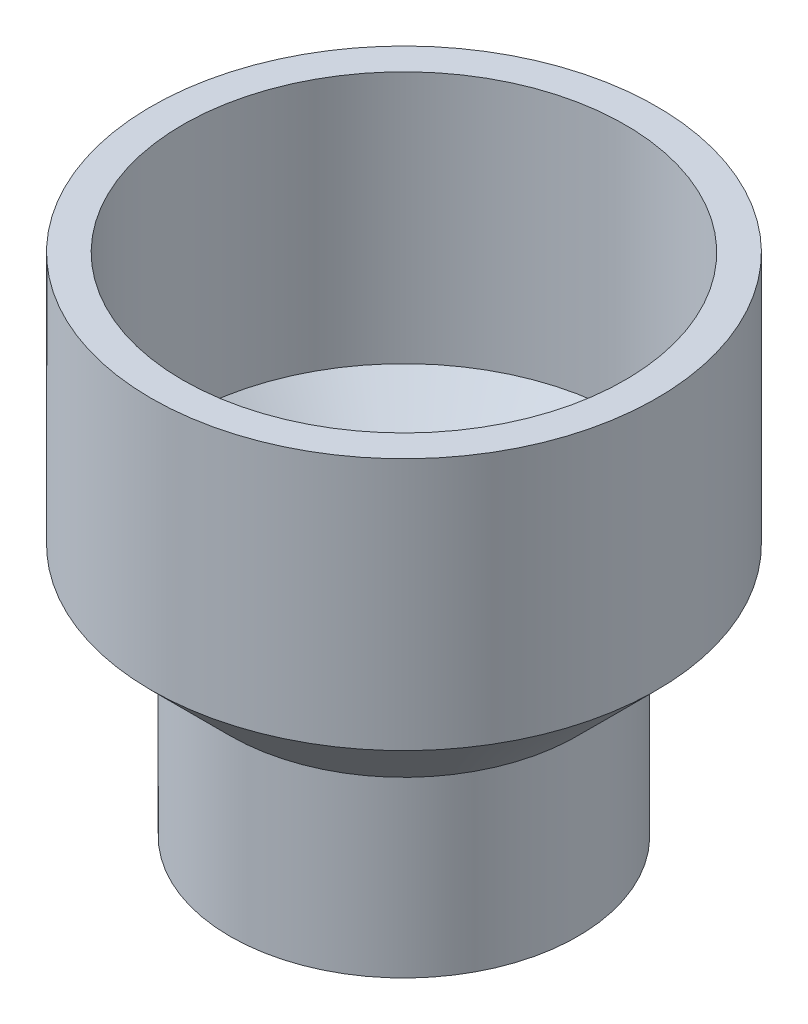
ISO-10303-21;
HEADER;
FILE_DESCRIPTION(('STEP AP214'),'2;1');
FILE_NAME('part.step','',(''),(''),'','','');
FILE_SCHEMA(('AUTOMOTIVE_DESIGN { 1 0 10303 214 1 1 1 1 }'));
ENDSEC;
DATA;
#1=APPLICATION_CONTEXT('core data for automotive mechanical design processes');
#2=APPLICATION_PROTOCOL_DEFINITION('international standard','automotive_design',2000,#1);
#3=PRODUCT_CONTEXT('',#1,'mechanical');
#4=PRODUCT('Part','Part','',(#3));
#5=PRODUCT_RELATED_PRODUCT_CATEGORY('part','',(#4));
#6=PRODUCT_DEFINITION_FORMATION('','',#4);
#7=PRODUCT_DEFINITION_CONTEXT('part definition',#1,'design');
#8=PRODUCT_DEFINITION('design','',#6,#7);
#9=PRODUCT_DEFINITION_SHAPE('','',#8);
#10=(LENGTH_UNIT() NAMED_UNIT(*) SI_UNIT(.MILLI.,.METRE.));
#11=(NAMED_UNIT(*) PLANE_ANGLE_UNIT() SI_UNIT($,.RADIAN.));
#12=(NAMED_UNIT(*) SI_UNIT($,.STERADIAN.) SOLID_ANGLE_UNIT());
#13=UNCERTAINTY_MEASURE_WITH_UNIT(LENGTH_MEASURE(1.E-05),#10,'distance_accuracy_value','');
#14=(GEOMETRIC_REPRESENTATION_CONTEXT(3) GLOBAL_UNCERTAINTY_ASSIGNED_CONTEXT((#13)) GLOBAL_UNIT_ASSIGNED_CONTEXT((#10,
#11,#12)) REPRESENTATION_CONTEXT('',''));
#15=CARTESIAN_POINT('',(0.,0.,0.));
#16=DIRECTION('',(0.,0.,1.));
#17=DIRECTION('',(1.,0.,0.));
#18=AXIS2_PLACEMENT_3D('',#15,#16,#17);
#19=CARTESIAN_POINT('',(0.,34.925,0.));
#20=DIRECTION('',(0.,1.,0.));
#21=DIRECTION('',(0.,0.,1.));
#22=AXIS2_PLACEMENT_3D('',#19,#20,#21);
#23=CONICAL_SURFACE('',#22,34.925,0.785398163397448);
#24=CARTESIAN_POINT('',(0.,50.8,0.));
#25=DIRECTION('',(0.,1.,0.));
#26=DIRECTION('',(0.,0.,1.));
#27=AXIS2_PLACEMENT_3D('',#24,#25,#26);
#28=CIRCLE('',#27,50.8);
#29=CARTESIAN_POINT('',(0.,50.8,50.8));
#30=VERTEX_POINT('',#29);
#31=EDGE_CURVE('E159',#30,#30,#28,.T.);
#32=ORIENTED_EDGE('',*,*,#31,.F.);
#33=EDGE_LOOP('',(#32));
#34=FACE_BOUND('',#33,.T.);
#35=CARTESIAN_POINT('',(-34.1928216678749,34.2136269063048,-1.19298469090279));
#36=CARTESIAN_POINT('',(-34.2815739286729,34.3071873596383,-1.33248830232444));
#37=CARTESIAN_POINT('',(-34.3822644038496,34.4129396518823,-1.45643275915809));
#38=CARTESIAN_POINT('',(-34.5442564447268,34.582172549158,-1.61977001671834));
#39=CARTESIAN_POINT('',(-34.6002611328489,34.6405386421686,-1.67056850402385));
#40=CARTESIAN_POINT('',(-34.715282358,34.7600926195074,-1.76498823194821));
#41=CARTESIAN_POINT('',(-34.774298251011,34.8212799001898,-1.80861099890575));
#42=CARTESIAN_POINT('',(-34.9050947539035,34.9565176618946,-1.89588157729996));
#43=CARTESIAN_POINT('',(-34.9773212813115,35.0309664446712,-1.93823584793034));
#44=CARTESIAN_POINT('',(-35.1243007538351,35.1819721298896,-2.01389412130694));
#45=CARTESIAN_POINT('',(-35.199055139687,35.2585302297571,-2.04719286172636));
#46=CARTESIAN_POINT('',(-35.4259401828212,35.490114077902,-2.13388822541286));
#47=CARTESIAN_POINT('',(-35.580969406127,35.6473357179681,-2.17426257163315));
#48=CARTESIAN_POINT('',(-35.8979237012877,35.966618306716,-2.22190034727807));
#49=CARTESIAN_POINT('',(-36.0599254518491,36.1287094895024,-2.22841353334702));
#50=CARTESIAN_POINT('',(-36.383865205535,36.4506683988246,-2.20591729754882));
#51=CARTESIAN_POINT('',(-36.5458032143611,36.6105364279312,-2.1769127584516));
#52=CARTESIAN_POINT('',(-36.8391267528299,36.8982845680241,-2.08910685997467));
#53=CARTESIAN_POINT('',(-36.9712142280511,37.027153264726,-2.035889583643));
#54=CARTESIAN_POINT('',(-37.2284087290584,37.2768407889738,-1.90104899976281));
#55=CARTESIAN_POINT('',(-37.3535257326408,37.3976711736399,-1.81946757258494));
#56=CARTESIAN_POINT('',(-37.5589466670998,37.5951863219014,-1.65198312741879));
#57=CARTESIAN_POINT('',(-37.6421802400883,37.6749365264546,-1.57329728470783));
#58=CARTESIAN_POINT('',(-37.799000676044,37.8247693154842,-1.39887434923891));
#59=CARTESIAN_POINT('',(-37.8726015345278,37.8948659337248,-1.30316248213122));
#60=CARTESIAN_POINT('',(-37.9918300356899,38.0081575473654,-1.11706977716215));
#61=CARTESIAN_POINT('',(-38.0400735206233,38.0538995201416,-1.02992930778994));
#62=CARTESIAN_POINT('',(-38.1257160336948,38.1349862807222,-0.845922810385251));
#63=CARTESIAN_POINT('',(-38.1631203510313,38.1703361396978,-0.749061556984511));
#64=CARTESIAN_POINT('',(-38.224852075787,38.2286238483345,-0.546606643749594));
#65=CARTESIAN_POINT('',(-38.24906133871,38.2514495724549,-0.440943552149376));
#66=CARTESIAN_POINT('',(-38.281752245055,38.2822623870848,-0.2251184870685));
#67=CARTESIAN_POINT('',(-38.2902492673325,38.2902639871922,-0.114961020681341));
#68=CARTESIAN_POINT('',(-38.2907054540785,38.2906933859733,0.0896977472742306));
#69=CARTESIAN_POINT('',(-38.2848411452526,38.2851708350689,0.184201578929087));
#70=CARTESIAN_POINT('',(-38.2614233809035,38.2631028536059,0.370408022381201));
#71=CARTESIAN_POINT('',(-38.2438701735165,38.2465576570401,0.462110693599311));
#72=CARTESIAN_POINT('',(-38.1986120030856,38.2038531853297,0.638906156772312));
#73=CARTESIAN_POINT('',(-38.1710756476569,38.177853567228,0.724081806864399));
#74=CARTESIAN_POINT('',(-38.1073100233382,38.117564293387,0.887956022817296));
#75=CARTESIAN_POINT('',(-38.0710769638313,38.0832710226586,0.966651744138984));
#76=CARTESIAN_POINT('',(-37.9742799609917,37.9915047808101,1.14907154112584));
#77=CARTESIAN_POINT('',(-37.9099565287235,37.930408413165,1.24898640625059));
#78=CARTESIAN_POINT('',(-37.7706300816689,37.7976915269845,1.43316403567811));
#79=CARTESIAN_POINT('',(-37.6956048236597,37.726049078761,1.51739333589181));
#80=CARTESIAN_POINT('',(-37.5098788462459,37.5481281678714,1.69785652485617));
#81=CARTESIAN_POINT('',(-37.3960074508017,37.4386187016103,1.78763151333976));
#82=CARTESIAN_POINT('',(-37.1600471781957,37.2106052899615,1.94082134761576));
#83=CARTESIAN_POINT('',(-37.0379470207927,37.0920889680914,2.00419911677091));
#84=CARTESIAN_POINT('',(-36.7521712758416,36.813287791729,2.12175649282107));
#85=CARTESIAN_POINT('',(-36.5869239390453,36.651057273554,2.16760495077396));
#86=CARTESIAN_POINT('',(-36.3377675947883,36.4047650670886,2.20767213781184));
#87=CARTESIAN_POINT('',(-36.2544202526825,36.3220954387245,2.21623798216892));
#88=CARTESIAN_POINT('',(-36.0877889324423,36.156251207392,2.22397628877756));
#89=CARTESIAN_POINT('',(-36.0045049567959,36.0730765856414,2.2231483994826));
#90=CARTESIAN_POINT('',(-35.753681817889,35.8217056139591,2.20658279451753));
#91=CARTESIAN_POINT('',(-35.5868938399194,35.6533643114749,2.17649178394227));
#92=CARTESIAN_POINT('',(-35.3422090532195,35.4046808172658,2.10237603597874));
#93=CARTESIAN_POINT('',(-35.2615705162135,35.3224314730166,2.07284479223785));
#94=CARTESIAN_POINT('',(-35.1026998954672,35.159832607027,2.00379589214626));
#95=CARTESIAN_POINT('',(-35.0244668567957,35.0794823344048,1.96428225753559));
#96=CARTESIAN_POINT('',(-34.8413319578,34.8907612451981,1.8574211553895));
#97=CARTESIAN_POINT('',(-34.7378966197466,34.7836515335427,1.78522577312632));
#98=CARTESIAN_POINT('',(-34.5401937781012,34.5780395287206,1.61923861818103));
#99=CARTESIAN_POINT('',(-34.4459120147098,34.4795238725092,1.52548122908911));
#100=CARTESIAN_POINT('',(-34.2942988888423,34.3205038368468,1.34296492978056));
#101=CARTESIAN_POINT('',(-34.2338248601263,34.2568755318755,1.25956147613049));
#102=CARTESIAN_POINT('',(-34.1227113007635,34.1396866188751,1.08002784435743));
#103=CARTESIAN_POINT('',(-34.0720577520681,34.0861116639546,0.983916141194465));
#104=CARTESIAN_POINT('',(-33.9929352215248,34.0022741402853,0.80086872463288));
#105=CARTESIAN_POINT('',(-33.9620445265015,33.9694815765301,0.716150908403326));
#106=CARTESIAN_POINT('',(-33.9102655141043,33.9144594049002,0.540421000340964));
#107=CARTESIAN_POINT('',(-33.8893695812095,33.8922217547961,0.449413761451168));
#108=CARTESIAN_POINT('',(-33.8590459510252,33.8599364012714,0.262715280396128));
#109=CARTESIAN_POINT('',(-33.8496937197498,33.8499689141696,0.166997425448759));
#110=CARTESIAN_POINT('',(-33.8435655657787,33.8434386868558,-0.0252936843850653));
#111=CARTESIAN_POINT('',(-33.8467859394926,33.846871999087,-0.121866679005382));
#112=CARTESIAN_POINT('',(-33.8645161226032,33.8657597889114,-0.302591756849646));
#113=CARTESIAN_POINT('',(-33.8778347412147,33.8799458239408,-0.387002246416707));
#114=CARTESIAN_POINT('',(-33.9134089506826,33.9177963133625,-0.551676413411459));
#115=CARTESIAN_POINT('',(-33.935666654962,33.9414630092163,-0.631939105127771));
#116=CARTESIAN_POINT('',(-33.9915413043621,34.00078958663,-0.797825528583115));
#117=CARTESIAN_POINT('',(-34.0263145311833,34.0376669904231,-0.882619154583177));
#118=CARTESIAN_POINT('',(-34.1039219363454,34.1198051214229,-1.04400576240388));
#119=CARTESIAN_POINT('',(-34.1467643111159,34.1650743721049,-1.12059028040963));
#120=CARTESIAN_POINT('',(-34.1928216678749,34.2136269063048,-1.19298469090279));
#121=B_SPLINE_CURVE_WITH_KNOTS('',3,(#35,#36,#37,#38,#39,#40,#41,#42,#43,#44,#45,#46,#47,#48,
#49,#50,#51,#52,#53,#54,#55,#56,#57,#58,#59,#60,#61,#62,#63,#64,#65,#66,#67,#68,#69,#70,#71,#72,
#73,#74,#75,#76,#77,#78,#79,#80,#81,#82,#83,#84,#85,#86,#87,#88,#89,#90,#91,#92,#93,#94,#95,#96,
#97,#98,#99,#100,#101,#102,#103,#104,#105,#106,#107,#108,#109,#110,#111,#112,#113,#114,#115,
#116,#117,#118,#119,#120),.UNSPECIFIED.,.T.,.F.,(4,2,2,2,2,2,2,2,2,2,2,2,2,2,2,2,2,2,2,2,2,2,2,
2,2,2,2,2,2,2,2,2,2,2,2,2,2,2,2,2,2,2,4),(0.,0.56930427315891,0.855648265760131,
1.14193127150024,1.47759449476423,1.81345236298535,2.48387467881956,3.16908975068613,
3.85421063375119,4.42841530296703,5.00177572028793,5.41911169018283,5.83583441090758,
6.16340200162617,6.49080947868913,6.82110221990237,7.15107150511431,7.43419718596454,
7.71731685670932,7.99586207160034,8.27452891667899,8.67315674735451,9.07262551722157,
9.61478426544557,10.1577019641733,10.8619682427121,11.2147825649174,11.5676100907178,
12.2804980469708,12.6368792393542,12.9931170799926,13.4879563576247,13.9820119511951,
14.3440869735493,14.7056412911163,14.9923652428618,15.2788703755501,15.5672387587313,
15.855522201856,16.1142520185619,16.3730430414954,16.6681780361975,16.9636144541266),.UNSPECIFIED.);
#122=CARTESIAN_POINT('',(-34.874636003521,34.9249999999998,-1.87493696478331));
#123=VERTEX_POINT('',#122);
#124=CARTESIAN_POINT('',(-34.8746360035211,34.925,1.87493696478255));
#125=VERTEX_POINT('',#124);
#126=EDGE_CURVE('E73',#123,#125,#121,.T.);
#127=ORIENTED_EDGE('',*,*,#126,.T.);
#128=CARTESIAN_POINT('',(0.,34.925,0.));
#129=DIRECTION('',(0.,1.,0.));
#130=DIRECTION('',(0.,0.,1.));
#131=AXIS2_PLACEMENT_3D('',#128,#129,#130);
#132=CIRCLE('',#131,34.925);
#133=EDGE_CURVE('E61',#125,#123,#132,.T.);
#134=ORIENTED_EDGE('',*,*,#133,.T.);
#135=EDGE_LOOP('',(#127,#134));
#136=FACE_BOUND('',#135,.T.);
#137=ADVANCED_FACE('F46',(#34,#136),#23,.T.);
#138=CARTESIAN_POINT('',(0.,50.8,0.));
#139=DIRECTION('',(0.,1.,0.));
#140=DIRECTION('',(0.,0.,1.));
#141=AXIS2_PLACEMENT_3D('',#138,#139,#140);
#142=CONICAL_SURFACE('',#141,44.45,0.80667154942151);
#143=CARTESIAN_POINT('',(0.,36.195,0.));
#144=DIRECTION('',(0.,1.,0.));
#145=DIRECTION('',(0.,0.,1.));
#146=AXIS2_PLACEMENT_3D('',#143,#144,#145);
#147=CIRCLE('',#146,29.21);
#148=CARTESIAN_POINT('',(0.,36.195,29.21));
#149=VERTEX_POINT('',#148);
#150=EDGE_CURVE('E139',#149,#149,#147,.T.);
#151=ORIENTED_EDGE('',*,*,#150,.F.);
#152=EDGE_LOOP('',(#151));
#153=FACE_BOUND('',#152,.T.);
#154=CARTESIAN_POINT('',(0.,50.8,0.));
#155=DIRECTION('',(0.,1.,0.));
#156=DIRECTION('',(0.,0.,1.));
#157=AXIS2_PLACEMENT_3D('',#154,#155,#156);
#158=CIRCLE('',#157,44.45);
#159=CARTESIAN_POINT('',(0.,50.8,44.45));
#160=VERTEX_POINT('',#159);
#161=EDGE_CURVE('E135',#160,#160,#158,.T.);
#162=ORIENTED_EDGE('',*,*,#161,.T.);
#163=EDGE_LOOP('',(#162));
#164=FACE_BOUND('',#163,.T.);
#165=CARTESIAN_POINT('',(-36.5259818198455,43.2681417658696,-2.17480088805643));
#166=CARTESIAN_POINT('',(-36.661001675679,43.3956873847848,-2.14636979127616));
#167=CARTESIAN_POINT('',(-36.794969011842,43.5215387539893,-2.10506606877575));
#168=CARTESIAN_POINT('',(-37.0576729797944,43.7670658510139,-1.9950760341765));
#169=CARTESIAN_POINT('',(-37.1864068978209,43.8867383832996,-1.9263757103528));
#170=CARTESIAN_POINT('',(-37.4071014862912,44.0909484250745,-1.77763755899297));
#171=CARTESIAN_POINT('',(-37.5010009673615,44.1774934150706,-1.7032495605437));
#172=CARTESIAN_POINT('',(-37.679426899241,44.3414076145758,-1.53549774165439));
#173=CARTESIAN_POINT('',(-37.763967560989,44.4187907487171,-1.44216331863202));
#174=CARTESIAN_POINT('',(-37.9029227259978,44.5456357267972,-1.25813052844446));
#175=CARTESIAN_POINT('',(-37.9599227085555,44.5975375479028,-1.17107889261206));
#176=CARTESIAN_POINT('',(-38.0628253849848,44.6910731274425,-0.985588522482347));
#177=CARTESIAN_POINT('',(-38.1087404991799,44.7327183791758,-0.887162717308619));
#178=CARTESIAN_POINT('',(-38.1806420453065,44.7978540353061,-0.696415895481467));
#179=CARTESIAN_POINT('',(-38.2086013015951,44.8231459347913,-0.605459042442303));
#180=CARTESIAN_POINT('',(-38.2528512939901,44.8631497925646,-0.418496456156211));
#181=CARTESIAN_POINT('',(-38.2691483348075,44.8778674674023,-0.322493481074282));
#182=CARTESIAN_POINT('',(-38.2889874264714,44.8957815496228,-0.12777353628579));
#183=CARTESIAN_POINT('',(-38.2924876110624,44.8989401402836,-0.0290487210961127));
#184=CARTESIAN_POINT('',(-38.2863508290911,44.8934002416069,0.167654618383073));
#185=CARTESIAN_POINT('',(-38.2767134163107,44.8847013495307,0.265633117210316));
#186=CARTESIAN_POINT('',(-38.2458525498616,44.8568224467192,0.452760023223517));
#187=CARTESIAN_POINT('',(-38.2252632299344,44.8382160410486,0.5421020372786));
#188=CARTESIAN_POINT('',(-38.1741513037724,44.7919733807713,0.71540403300947));
#189=CARTESIAN_POINT('',(-38.1436268782013,44.7643354722942,0.79936302556242));
#190=CARTESIAN_POINT('',(-38.0710900748298,44.6985611410484,0.967598230497573));
#191=CARTESIAN_POINT('',(-38.0283075512628,44.659718942241,1.05126253267649));
#192=CARTESIAN_POINT('',(-37.9346776036788,44.5745486492664,1.20975707041488));
#193=CARTESIAN_POINT('',(-37.8838249821896,44.5282157304069,1.28458155822371));
#194=CARTESIAN_POINT('',(-37.747209411037,44.4034687360198,1.46222467643687));
#195=CARTESIAN_POINT('',(-37.6571892074395,44.3210313432812,1.55896841173131));
#196=CARTESIAN_POINT('',(-37.4671571777423,44.1463306940037,1.73159554747825));
#197=CARTESIAN_POINT('',(-37.3671218077256,44.0540442488081,1.80742814173825));
#198=CARTESIAN_POINT('',(-37.1271373419162,43.8317187679327,1.96062373564006));
#199=CARTESIAN_POINT('',(-36.9847662982478,43.6991435326702,2.03050520525936));
#200=CARTESIAN_POINT('',(-36.6946062522483,43.4273348507675,2.13795088669352));
#201=CARTESIAN_POINT('',(-36.5468151282252,43.2880987901103,2.17550229902914));
#202=CARTESIAN_POINT('',(-36.2470897914556,43.0039859465758,2.22054058898386));
#203=CARTESIAN_POINT('',(-36.0951286490201,42.8590528798231,2.22748066885134));
#204=CARTESIAN_POINT('',(-35.7927557245771,42.5688310100667,2.21058914491142));
#205=CARTESIAN_POINT('',(-35.6423463883226,42.4235419925798,2.18671477788865));
#206=CARTESIAN_POINT('',(-35.4105279846211,42.1982077054035,2.12480658614162));
#207=CARTESIAN_POINT('',(-35.3273058151122,42.1170173920728,2.09730229179691));
#208=CARTESIAN_POINT('',(-35.1631992237528,41.9563523836428,2.03190723721162));
#209=CARTESIAN_POINT('',(-35.0823156397849,41.876878305966,1.99401280408115));
#210=CARTESIAN_POINT('',(-34.9239742590018,41.7207600491715,1.90757148007161));
#211=CARTESIAN_POINT('',(-34.846508622514,41.644109468634,1.85905067205646));
#212=CARTESIAN_POINT('',(-34.6959214936443,41.4946157604691,1.75085518082706));
#213=CARTESIAN_POINT('',(-34.6227960921273,41.4217692139819,1.69119074162216));
#214=CARTESIAN_POINT('',(-34.4749999145291,41.2740818708901,1.55341075281249));
#215=CARTESIAN_POINT('',(-34.4009335301625,41.1997967332412,1.47403336512572));
#216=CARTESIAN_POINT('',(-34.2622770127271,41.060310318879,1.30045009759266));
#217=CARTESIAN_POINT('',(-34.1976710834445,40.9950939094133,1.20626949297401));
#218=CARTESIAN_POINT('',(-34.0927563854578,40.888927112644,1.02310946431996));
#219=CARTESIAN_POINT('',(-34.0501682675686,40.845727178956,0.936757692119643));
#220=CARTESIAN_POINT('',(-33.9754639461146,40.7698332725828,0.755253443197067));
#221=CARTESIAN_POINT('',(-33.9433426108928,40.7371341516706,0.660105308620978));
#222=CARTESIAN_POINT('',(-33.8916173644961,40.6844289961763,0.461982163732396));
#223=CARTESIAN_POINT('',(-33.8721333868937,40.6645445893649,0.358942249871895));
#224=CARTESIAN_POINT('',(-33.8480280553051,40.6399384209022,0.149383342579902));
#225=CARTESIAN_POINT('',(-33.843391448974,40.6352010990252,0.0428680330784697));
#226=CARTESIAN_POINT('',(-33.8489532804607,40.6408805807832,-0.153297480210282));
#227=CARTESIAN_POINT('',(-33.8570347248608,40.6491348795437,-0.243085267526754));
#228=CARTESIAN_POINT('',(-33.8836162797459,40.6762603998127,-0.419434323822031));
#229=CARTESIAN_POINT('',(-33.9021177501534,40.6951330071212,-0.505995170078767));
#230=CARTESIAN_POINT('',(-33.9484539662989,40.7423358781636,-0.674313995123649));
#231=CARTESIAN_POINT('',(-33.9763353666488,40.7707134150819,-0.756045516006443));
#232=CARTESIAN_POINT('',(-34.0399358207845,40.8353362398596,-0.913043913092566));
#233=CARTESIAN_POINT('',(-34.0756585031612,40.8715851701605,-0.988307773843636));
#234=CARTESIAN_POINT('',(-34.1739089986402,40.9710844086848,-1.16934957523724));
#235=CARTESIAN_POINT('',(-34.2406886225336,41.0385453523837,-1.27051742505544));
#236=CARTESIAN_POINT('',(-34.3850437252816,41.1838485058071,-1.45639406626953));
#237=CARTESIAN_POINT('',(-34.4626454984428,41.2617159802107,-1.54106152830388));
#238=CARTESIAN_POINT('',(-34.6568176637053,41.4557917153247,-1.72396077246119));
#239=CARTESIAN_POINT('',(-34.7769277083094,41.5752601119243,-1.81496288949073));
#240=CARTESIAN_POINT('',(-35.0265284898469,41.8220943565224,-1.96885323858367));
#241=CARTESIAN_POINT('',(-35.1560313648294,41.949470391561,-2.03170431182112));
#242=CARTESIAN_POINT('',(-35.4244991434315,42.2119794208019,-2.13225464687039));
#243=CARTESIAN_POINT('',(-35.5636270783533,42.3472296385404,-2.16920520198415));
#244=CARTESIAN_POINT('',(-35.8447400293673,42.6188622861585,-2.21583475720021));
#245=CARTESIAN_POINT('',(-35.9867192001109,42.7552421180395,-2.22556475513689));
#246=CARTESIAN_POINT('',(-36.2614779046729,43.0176133728407,-2.2180295337673));
#247=CARTESIAN_POINT('',(-36.3942309478818,43.14368417107,-2.20254363573276));
#248=CARTESIAN_POINT('',(-36.5259818198455,43.2681417658696,-2.17480088805643));
#249=B_SPLINE_CURVE_WITH_KNOTS('',3,(#165,#166,#167,#168,#169,#170,#171,#172,#173,#174,#175,
#176,#177,#178,#179,#180,#181,#182,#183,#184,#185,#186,#187,#188,#189,#190,#191,#192,#193,#194,
#195,#196,#197,#198,#199,#200,#201,#202,#203,#204,#205,#206,#207,#208,#209,#210,#211,#212,#213,
#214,#215,#216,#217,#218,#219,#220,#221,#222,#223,#224,#225,#226,#227,#228,#229,#230,#231,#232,
#233,#234,#235,#236,#237,#238,#239,#240,#241,#242,#243,#244,#245,#246,#247,#248),.UNSPECIFIED.,
.T.,.F.,(4,2,2,2,2,2,2,2,2,2,2,2,2,2,2,2,2,2,2,2,2,2,2,2,2,2,2,2,2,2,2,2,2,2,2,2,2,2,2,2,2,4),
(0.,0.563268731436876,1.12682591140014,1.56871457506684,2.00992277084337,2.35746648428044,
2.70461895710865,2.99874180649918,3.29270552974472,3.5876301298232,3.88256474725184,
4.16203160447773,4.44154966705047,4.74546434821791,5.04957556317959,5.51423325154916,
5.98001013066666,6.59686278100767,7.21395953134459,7.84203571526464,8.47098445931379,
8.82900336953943,9.18714900214803,9.54442521243488,9.90137459155334,10.2947654435001,
10.6874917680632,11.0028851192902,11.3181236059046,11.6363116757588,11.954172773683,
12.2244478414961,12.4947581912094,12.7664334132865,13.0382346204186,13.4520869207453,
13.8669628582642,14.4407768327551,15.0153460142492,15.6059065203723,16.195359865432,
16.7449912219355),.UNSPECIFIED.);
#250=CARTESIAN_POINT('',(-36.5259818198455,43.2681417658696,-2.17480088805643));
#251=VERTEX_POINT('',#250);
#252=EDGE_CURVE('E50',#251,#251,#249,.T.);
#253=ORIENTED_EDGE('',*,*,#252,.F.);
#254=EDGE_LOOP('',(#253));
#255=FACE_BOUND('',#254,.T.);
#256=ADVANCED_FACE('F94',(#153,#164,#255),#142,.F.);
#257=CARTESIAN_POINT('',(0.,50.8,0.));
#258=DIRECTION('',(0.,-1.,0.));
#259=DIRECTION('',(0.,0.,-1.));
#260=AXIS2_PLACEMENT_3D('',#257,#258,#259);
#261=CYLINDRICAL_SURFACE('',#260,30.1625);
#262=CARTESIAN_POINT('',(0.,0.,0.));
#263=DIRECTION('',(0.,1.,0.));
#264=DIRECTION('',(0.,0.,1.));
#265=AXIS2_PLACEMENT_3D('',#262,#263,#264);
#266=CIRCLE('',#265,30.1625);
#267=CARTESIAN_POINT('',(0.,0.,30.1625));
#268=VERTEX_POINT('',#267);
#269=EDGE_CURVE('E163',#268,#268,#266,.T.);
#270=ORIENTED_EDGE('',*,*,#269,.F.);
#271=EDGE_LOOP('',(#270));
#272=FACE_BOUND('',#271,.T.);
#273=CARTESIAN_POINT('',(0.,35.7124,0.));
#274=DIRECTION('',(0.,1.,0.));
#275=DIRECTION('',(0.,0.,1.));
#276=AXIS2_PLACEMENT_3D('',#273,#274,#275);
#277=CIRCLE('',#276,30.1625);
#278=CARTESIAN_POINT('',(0.,35.7124,30.1625));
#279=VERTEX_POINT('',#278);
#280=EDGE_CURVE('E143',#279,#279,#277,.F.);
#281=ORIENTED_EDGE('',*,*,#280,.F.);
#282=EDGE_LOOP('',(#281));
#283=FACE_BOUND('',#282,.T.);
#284=ADVANCED_FACE('F86',(#272,#283),#261,.F.);
#285=CARTESIAN_POINT('',(0.,50.8,0.));
#286=DIRECTION('',(0.,-1.,0.));
#287=DIRECTION('',(0.,0.,-1.));
#288=AXIS2_PLACEMENT_3D('',#285,#286,#287);
#289=CYLINDRICAL_SURFACE('',#288,34.925);
#290=CARTESIAN_POINT('',(0.,0.,0.));
#291=DIRECTION('',(0.,1.,0.));
#292=DIRECTION('',(0.,0.,1.));
#293=AXIS2_PLACEMENT_3D('',#290,#291,#292);
#294=CIRCLE('',#293,34.925);
#295=CARTESIAN_POINT('',(0.,0.,34.925));
#296=VERTEX_POINT('',#295);
#297=EDGE_CURVE('E83',#296,#296,#294,.T.);
#298=ORIENTED_EDGE('',*,*,#297,.T.);
#299=EDGE_LOOP('',(#298));
#300=FACE_BOUND('',#299,.T.);
#301=EDGE_CURVE('E12',#123,#125,#132,.T.);
#302=ORIENTED_EDGE('',*,*,#301,.F.);
#303=ORIENTED_EDGE('',*,*,#133,.F.);
#304=EDGE_LOOP('',(#302,#303));
#305=FACE_BOUND('',#304,.T.);
#306=ADVANCED_FACE('F48',(#300,#305),#289,.T.);
#307=CARTESIAN_POINT('',(0.,0.,0.));
#308=DIRECTION('',(0.,1.,0.));
#309=DIRECTION('',(0.,0.,1.));
#310=AXIS2_PLACEMENT_3D('',#307,#308,#309);
#311=PLANE('',#310);
#312=ORIENTED_EDGE('',*,*,#297,.F.);
#313=EDGE_LOOP('',(#312));
#314=FACE_BOUND('',#313,.T.);
#315=ORIENTED_EDGE('',*,*,#269,.T.);
#316=EDGE_LOOP('',(#315));
#317=FACE_BOUND('',#316,.T.);
#318=ADVANCED_FACE('F85',(#314,#317),#311,.F.);
#319=CARTESIAN_POINT('',(0.,101.6,0.));
#320=DIRECTION('',(0.,1.,0.));
#321=DIRECTION('',(0.,0.,1.));
#322=AXIS2_PLACEMENT_3D('',#319,#320,#321);
#323=PLANE('',#322);
#324=CARTESIAN_POINT('',(0.,101.6,0.));
#325=DIRECTION('',(0.,1.,0.));
#326=DIRECTION('',(0.,0.,1.));
#327=AXIS2_PLACEMENT_3D('',#324,#325,#326);
#328=CIRCLE('',#327,50.8);
#329=CARTESIAN_POINT('',(0.,101.6,50.8));
#330=VERTEX_POINT('',#329);
#331=EDGE_CURVE('E155',#330,#330,#328,.T.);
#332=ORIENTED_EDGE('',*,*,#331,.T.);
#333=EDGE_LOOP('',(#332));
#334=FACE_BOUND('',#333,.T.);
#335=CARTESIAN_POINT('',(0.,101.6,0.));
#336=DIRECTION('',(0.,1.,0.));
#337=DIRECTION('',(0.,0.,1.));
#338=AXIS2_PLACEMENT_3D('',#335,#336,#337);
#339=CIRCLE('',#338,44.45);
#340=CARTESIAN_POINT('',(0.,101.6,44.45));
#341=VERTEX_POINT('',#340);
#342=EDGE_CURVE('E151',#341,#341,#339,.T.);
#343=ORIENTED_EDGE('',*,*,#342,.F.);
#344=EDGE_LOOP('',(#343));
#345=FACE_BOUND('',#344,.T.);
#346=ADVANCED_FACE('F92',(#334,#345),#323,.T.);
#347=CARTESIAN_POINT('',(0.,101.6,0.));
#348=DIRECTION('',(0.,-1.,0.));
#349=DIRECTION('',(0.,0.,-1.));
#350=AXIS2_PLACEMENT_3D('',#347,#348,#349);
#351=CYLINDRICAL_SURFACE('',#350,50.8);
#352=ORIENTED_EDGE('',*,*,#331,.F.);
#353=EDGE_LOOP('',(#352));
#354=FACE_BOUND('',#353,.T.);
#355=ORIENTED_EDGE('',*,*,#31,.T.);
#356=EDGE_LOOP('',(#355));
#357=FACE_BOUND('',#356,.T.);
#358=ADVANCED_FACE('F107',(#354,#357),#351,.T.);
#359=CARTESIAN_POINT('',(0.,101.6,0.));
#360=DIRECTION('',(0.,-1.,0.));
#361=DIRECTION('',(0.,0.,-1.));
#362=AXIS2_PLACEMENT_3D('',#359,#360,#361);
#363=CYLINDRICAL_SURFACE('',#362,44.45);
#364=ORIENTED_EDGE('',*,*,#342,.T.);
#365=EDGE_LOOP('',(#364));
#366=FACE_BOUND('',#365,.T.);
#367=ORIENTED_EDGE('',*,*,#161,.F.);
#368=EDGE_LOOP('',(#367));
#369=FACE_BOUND('',#368,.T.);
#370=ADVANCED_FACE('F110',(#366,#369),#363,.F.);
#371=CARTESIAN_POINT('',(0.,-85.312433150157,0.));
#372=DIRECTION('',(0.,1.,0.));
#373=DIRECTION('',(0.,0.,1.));
#374=AXIS2_PLACEMENT_3D('',#371,#372,#373);
#375=CYLINDRICAL_SURFACE('',#374,29.21);
#376=ORIENTED_EDGE('',*,*,#150,.T.);
#377=EDGE_LOOP('',(#376));
#378=FACE_BOUND('',#377,.T.);
#379=CARTESIAN_POINT('',(0.,35.7124,0.));
#380=DIRECTION('',(0.,1.,0.));
#381=DIRECTION('',(0.,0.,1.));
#382=AXIS2_PLACEMENT_3D('',#379,#380,#381);
#383=CIRCLE('',#382,29.21);
#384=CARTESIAN_POINT('',(0.,35.7124,29.21));
#385=VERTEX_POINT('',#384);
#386=EDGE_CURVE('E147',#385,#385,#383,.F.);
#387=ORIENTED_EDGE('',*,*,#386,.T.);
#388=EDGE_LOOP('',(#387));
#389=FACE_BOUND('',#388,.T.);
#390=ADVANCED_FACE('F117',(#378,#389),#375,.F.);
#391=CARTESIAN_POINT('',(0.,35.7124,0.));
#392=DIRECTION('',(0.,1.,0.));
#393=DIRECTION('',(0.,0.,1.));
#394=AXIS2_PLACEMENT_3D('',#391,#392,#393);
#395=PLANE('',#394);
#396=ORIENTED_EDGE('',*,*,#280,.T.);
#397=EDGE_LOOP('',(#396));
#398=FACE_BOUND('',#397,.T.);
#399=ORIENTED_EDGE('',*,*,#386,.F.);
#400=EDGE_LOOP('',(#399));
#401=FACE_BOUND('',#400,.T.);
#402=ADVANCED_FACE('F121',(#398,#401),#395,.F.);
#403=CARTESIAN_POINT('',(0.,34.925,0.));
#404=DIRECTION('',(0.,1.,0.));
#405=DIRECTION('',(0.,0.,1.));
#406=AXIS2_PLACEMENT_3D('',#403,#404,#405);
#407=CONICAL_SURFACE('',#406,34.925,0.785398163397448);
#408=ORIENTED_EDGE('',*,*,#301,.T.);
#409=EDGE_CURVE('E67',#125,#123,#121,.T.);
#410=ORIENTED_EDGE('',*,*,#409,.T.);
#411=EDGE_LOOP('',(#408,#410));
#412=FACE_BOUND('',#411,.T.);
#413=ADVANCED_FACE('F69',(#412),#407,.F.);
#414=CARTESIAN_POINT('',(-36.068,-0.001000000000001,0.));
#415=DIRECTION('',(0.,1.,0.));
#416=DIRECTION('',(0.,0.,1.));
#417=AXIS2_PLACEMENT_3D('',#414,#415,#416);
#418=CYLINDRICAL_SURFACE('',#417,2.2225);
#419=ORIENTED_EDGE('',*,*,#126,.F.);
#420=ORIENTED_EDGE('',*,*,#409,.F.);
#421=EDGE_LOOP('',(#419,#420));
#422=FACE_BOUND('',#421,.T.);
#423=ORIENTED_EDGE('',*,*,#252,.T.);
#424=EDGE_LOOP('',(#423));
#425=FACE_BOUND('',#424,.T.);
#426=ADVANCED_FACE('F76',(#422,#425),#418,.F.);
#427=CLOSED_SHELL('',(#137,#256,#284,#306,#318,#346,#358,#370,#390,#402,#413,#426));
#428=MANIFOLD_SOLID_BREP('B2',#427);
#429=ADVANCED_BREP_SHAPE_REPRESENTATION('',(#18,#428),#14);
#430=SHAPE_DEFINITION_REPRESENTATION(#9,#429);
ENDSEC;
END-ISO-10303-21;
